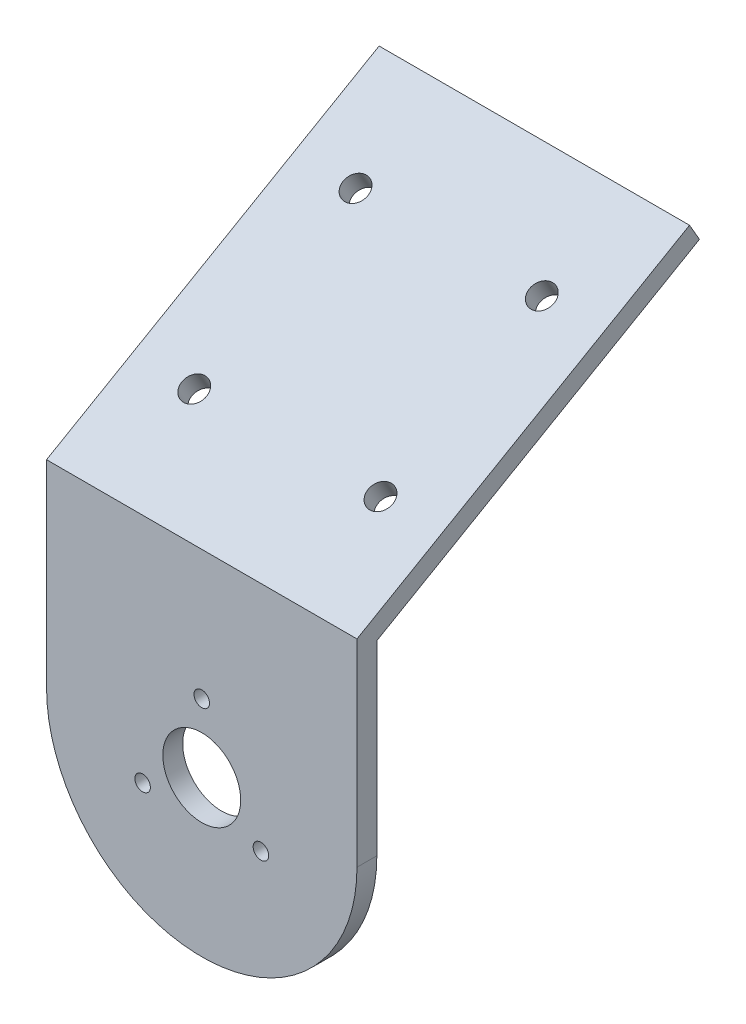
ISO-10303-21;
HEADER;
FILE_DESCRIPTION(('STEP AP214'),'2;1');
FILE_NAME('part.step','',(''),(''),'','','');
FILE_SCHEMA(('AUTOMOTIVE_DESIGN { 1 0 10303 214 1 1 1 1 }'));
ENDSEC;
DATA;
#1=APPLICATION_CONTEXT('core data for automotive mechanical design processes');
#2=APPLICATION_PROTOCOL_DEFINITION('international standard','automotive_design',2000,#1);
#3=PRODUCT_CONTEXT('',#1,'mechanical');
#4=PRODUCT('Part','Part','',(#3));
#5=PRODUCT_RELATED_PRODUCT_CATEGORY('part','',(#4));
#6=PRODUCT_DEFINITION_FORMATION('','',#4);
#7=PRODUCT_DEFINITION_CONTEXT('part definition',#1,'design');
#8=PRODUCT_DEFINITION('design','',#6,#7);
#9=PRODUCT_DEFINITION_SHAPE('','',#8);
#10=(LENGTH_UNIT() NAMED_UNIT(*) SI_UNIT(.MILLI.,.METRE.));
#11=(NAMED_UNIT(*) PLANE_ANGLE_UNIT() SI_UNIT($,.RADIAN.));
#12=(NAMED_UNIT(*) SI_UNIT($,.STERADIAN.) SOLID_ANGLE_UNIT());
#13=UNCERTAINTY_MEASURE_WITH_UNIT(LENGTH_MEASURE(1.E-05),#10,'distance_accuracy_value','');
#14=(GEOMETRIC_REPRESENTATION_CONTEXT(3) GLOBAL_UNCERTAINTY_ASSIGNED_CONTEXT((#13)) GLOBAL_UNIT_ASSIGNED_CONTEXT((#10,
#11,#12)) REPRESENTATION_CONTEXT('',''));
#15=CARTESIAN_POINT('',(0.,0.,0.));
#16=DIRECTION('',(0.,0.,1.));
#17=DIRECTION('',(1.,0.,0.));
#18=AXIS2_PLACEMENT_3D('',#15,#16,#17);
#19=CARTESIAN_POINT('',(9.526279441629,-5.5,77.5303437365925));
#20=DIRECTION('',(0.,0.,-1.));
#21=DIRECTION('',(-1.,0.,0.));
#22=AXIS2_PLACEMENT_3D('',#19,#20,#21);
#23=CYLINDRICAL_SURFACE('',#22,1.24999999999999);
#24=CARTESIAN_POINT('',(9.526279441629,-5.5,0.));
#25=DIRECTION('',(0.,0.,1.));
#26=DIRECTION('',(1.,0.,0.));
#27=AXIS2_PLACEMENT_3D('',#24,#25,#26);
#28=CIRCLE('',#27,1.24999999999999);
#29=CARTESIAN_POINT('',(10.776279441629,-5.5,0.));
#30=VERTEX_POINT('',#29);
#31=EDGE_CURVE('E120',#30,#30,#28,.T.);
#32=ORIENTED_EDGE('',*,*,#31,.F.);
#33=EDGE_LOOP('',(#32));
#34=FACE_BOUND('',#33,.T.);
#35=CARTESIAN_POINT('',(9.526279441629,-5.5,3.19999999999999));
#36=DIRECTION('',(0.,0.,1.));
#37=DIRECTION('',(1.,0.,0.));
#38=AXIS2_PLACEMENT_3D('',#35,#36,#37);
#39=CIRCLE('',#38,1.24999999999999);
#40=CARTESIAN_POINT('',(10.776279441629,-5.5,3.19999999999999));
#41=VERTEX_POINT('',#40);
#42=EDGE_CURVE('E139',#41,#41,#39,.T.);
#43=ORIENTED_EDGE('',*,*,#42,.T.);
#44=EDGE_LOOP('',(#43));
#45=FACE_BOUND('',#44,.T.);
#46=ADVANCED_FACE('F32',(#34,#45),#23,.F.);
#47=CARTESIAN_POINT('',(0.,11.,77.5303437365925));
#48=DIRECTION('',(0.,0.,-1.));
#49=DIRECTION('',(-1.,0.,0.));
#50=AXIS2_PLACEMENT_3D('',#47,#48,#49);
#51=CYLINDRICAL_SURFACE('',#50,1.24999999999999);
#52=CARTESIAN_POINT('',(0.,11.,0.));
#53=DIRECTION('',(0.,0.,1.));
#54=DIRECTION('',(1.,0.,0.));
#55=AXIS2_PLACEMENT_3D('',#52,#53,#54);
#56=CIRCLE('',#55,1.24999999999999);
#57=CARTESIAN_POINT('',(1.24999999999999,11.,0.));
#58=VERTEX_POINT('',#57);
#59=EDGE_CURVE('E117',#58,#58,#56,.T.);
#60=ORIENTED_EDGE('',*,*,#59,.F.);
#61=EDGE_LOOP('',(#60));
#62=FACE_BOUND('',#61,.T.);
#63=CARTESIAN_POINT('',(0.,11.,3.19999999999999));
#64=DIRECTION('',(0.,0.,1.));
#65=DIRECTION('',(1.,0.,0.));
#66=AXIS2_PLACEMENT_3D('',#63,#64,#65);
#67=CIRCLE('',#66,1.24999999999999);
#68=CARTESIAN_POINT('',(1.24999999999999,11.,3.19999999999999));
#69=VERTEX_POINT('',#68);
#70=EDGE_CURVE('E136',#69,#69,#67,.T.);
#71=ORIENTED_EDGE('',*,*,#70,.T.);
#72=EDGE_LOOP('',(#71));
#73=FACE_BOUND('',#72,.T.);
#74=ADVANCED_FACE('F208',(#62,#73),#51,.F.);
#75=CARTESIAN_POINT('',(0.,0.,77.5303437365925));
#76=DIRECTION('',(0.,0.,-1.));
#77=DIRECTION('',(-1.,0.,0.));
#78=AXIS2_PLACEMENT_3D('',#75,#76,#77);
#79=CYLINDRICAL_SURFACE('',#78,6.27324302627625);
#80=CARTESIAN_POINT('',(0.,0.,0.));
#81=DIRECTION('',(0.,0.,1.));
#82=DIRECTION('',(1.,0.,0.));
#83=AXIS2_PLACEMENT_3D('',#80,#81,#82);
#84=CIRCLE('',#83,6.27324302627625);
#85=CARTESIAN_POINT('',(6.27324302627625,0.,0.));
#86=VERTEX_POINT('',#85);
#87=EDGE_CURVE('E114',#86,#86,#84,.T.);
#88=ORIENTED_EDGE('',*,*,#87,.F.);
#89=EDGE_LOOP('',(#88));
#90=FACE_BOUND('',#89,.T.);
#91=CARTESIAN_POINT('',(0.,0.,3.19999999999999));
#92=DIRECTION('',(0.,0.,1.));
#93=DIRECTION('',(1.,0.,0.));
#94=AXIS2_PLACEMENT_3D('',#91,#92,#93);
#95=CIRCLE('',#94,6.27324302627625);
#96=CARTESIAN_POINT('',(6.27324302627625,0.,3.19999999999999));
#97=VERTEX_POINT('',#96);
#98=EDGE_CURVE('E133',#97,#97,#95,.T.);
#99=ORIENTED_EDGE('',*,*,#98,.T.);
#100=EDGE_LOOP('',(#99));
#101=FACE_BOUND('',#100,.T.);
#102=ADVANCED_FACE('F214',(#90,#101),#79,.F.);
#103=CARTESIAN_POINT('',(-25.,0.,77.5303437365925));
#104=DIRECTION('',(1.,0.,0.));
#105=DIRECTION('',(0.,1.,0.));
#106=AXIS2_PLACEMENT_3D('',#103,#104,#105);
#107=PLANE('',#106);
#108=DIRECTION('',(0.,-1.,0.));
#109=VECTOR('',#108,1.);
#110=CARTESIAN_POINT('',(-25.,0.,3.19999999999999));
#111=LINE('',#110,#109);
#112=CARTESIAN_POINT('',(-25.,31.8475208614068,3.19999999999999));
#113=VERTEX_POINT('',#112);
#114=CARTESIAN_POINT('',(-25.,0.,3.19999999999999));
#115=VERTEX_POINT('',#114);
#116=EDGE_CURVE('E130',#113,#115,#111,.T.);
#117=ORIENTED_EDGE('',*,*,#116,.F.);
#118=DIRECTION('',(0.,0.499999999999998,-0.86602540378444));
#119=VECTOR('',#118,1.);
#120=CARTESIAN_POINT('',(-25.,62.7712812921101,-50.3615242270664));
#121=LINE('',#120,#119);
#122=CARTESIAN_POINT('',(-25.,62.7712812921101,-50.3615242270664));
#123=VERTEX_POINT('',#122);
#124=EDGE_CURVE('E144',#113,#123,#121,.T.);
#125=ORIENTED_EDGE('',*,*,#124,.T.);
#126=DIRECTION('',(0.,-0.86602540378444,-0.499999999999998));
#127=VECTOR('',#126,1.);
#128=CARTESIAN_POINT('',(-25.,59.9999999999998,-51.9615242270664));
#129=LINE('',#128,#127);
#130=CARTESIAN_POINT('',(-25.,59.9999999999999,-51.9615242270664));
#131=VERTEX_POINT('',#130);
#132=EDGE_CURVE('E152',#123,#131,#129,.T.);
#133=ORIENTED_EDGE('',*,*,#132,.T.);
#134=DIRECTION('',(0.,-0.499999999999998,0.86602540378444));
#135=VECTOR('',#134,1.);
#136=CARTESIAN_POINT('',(-25.,30.,0.));
#137=LINE('',#136,#135);
#138=CARTESIAN_POINT('',(-25.,30.,0.));
#139=VERTEX_POINT('',#138);
#140=EDGE_CURVE('E142',#131,#139,#137,.T.);
#141=ORIENTED_EDGE('',*,*,#140,.T.);
#142=DIRECTION('',(0.,-1.,0.));
#143=VECTOR('',#142,1.);
#144=CARTESIAN_POINT('',(-25.,0.,0.));
#145=LINE('',#144,#143);
#146=CARTESIAN_POINT('',(-25.,0.,0.));
#147=VERTEX_POINT('',#146);
#148=EDGE_CURVE('E108',#139,#147,#145,.T.);
#149=ORIENTED_EDGE('',*,*,#148,.T.);
#150=DIRECTION('',(0.,0.,-1.));
#151=VECTOR('',#150,1.);
#152=CARTESIAN_POINT('',(-25.,0.,77.5303437365925));
#153=LINE('',#152,#151);
#154=EDGE_CURVE('E41',#115,#147,#153,.T.);
#155=ORIENTED_EDGE('',*,*,#154,.F.);
#156=EDGE_LOOP('',(#117,#125,#133,#141,#149,#155));
#157=FACE_BOUND('',#156,.T.);
#158=ADVANCED_FACE('F206',(#157),#107,.F.);
#159=CARTESIAN_POINT('',(25.,30.,77.5303437365925));
#160=DIRECTION('',(-1.,0.,0.));
#161=DIRECTION('',(0.,-1.,0.));
#162=AXIS2_PLACEMENT_3D('',#159,#160,#161);
#163=PLANE('',#162);
#164=DIRECTION('',(0.,1.,0.));
#165=VECTOR('',#164,1.);
#166=CARTESIAN_POINT('',(25.,30.,3.19999999999999));
#167=LINE('',#166,#165);
#168=CARTESIAN_POINT('',(25.,0.,3.19999999999999));
#169=VERTEX_POINT('',#168);
#170=CARTESIAN_POINT('',(25.,31.8475208614068,3.2));
#171=VERTEX_POINT('',#170);
#172=EDGE_CURVE('E47',#169,#171,#167,.T.);
#173=ORIENTED_EDGE('',*,*,#172,.F.);
#174=DIRECTION('',(0.,0.,-1.));
#175=VECTOR('',#174,1.);
#176=CARTESIAN_POINT('',(25.,0.,77.5303437365925));
#177=LINE('',#176,#175);
#178=CARTESIAN_POINT('',(25.,0.,0.));
#179=VERTEX_POINT('',#178);
#180=EDGE_CURVE('E11',#169,#179,#177,.T.);
#181=ORIENTED_EDGE('',*,*,#180,.T.);
#182=DIRECTION('',(0.,1.,0.));
#183=VECTOR('',#182,1.);
#184=CARTESIAN_POINT('',(25.,30.,0.));
#185=LINE('',#184,#183);
#186=CARTESIAN_POINT('',(25.,30.,0.));
#187=VERTEX_POINT('',#186);
#188=EDGE_CURVE('E99',#179,#187,#185,.T.);
#189=ORIENTED_EDGE('',*,*,#188,.T.);
#190=DIRECTION('',(0.,0.499999999999998,-0.86602540378444));
#191=VECTOR('',#190,1.);
#192=CARTESIAN_POINT('',(25.,30.,0.));
#193=LINE('',#192,#191);
#194=CARTESIAN_POINT('',(25.,59.9999999999999,-51.9615242270664));
#195=VERTEX_POINT('',#194);
#196=EDGE_CURVE('E84',#187,#195,#193,.T.);
#197=ORIENTED_EDGE('',*,*,#196,.T.);
#198=DIRECTION('',(0.,0.86602540378444,0.499999999999998));
#199=VECTOR('',#198,1.);
#200=CARTESIAN_POINT('',(25.,59.9999999999999,-51.9615242270664));
#201=LINE('',#200,#199);
#202=CARTESIAN_POINT('',(25.,62.7712812921101,-50.3615242270664));
#203=VERTEX_POINT('',#202);
#204=EDGE_CURVE('E95',#195,#203,#201,.T.);
#205=ORIENTED_EDGE('',*,*,#204,.T.);
#206=DIRECTION('',(0.,-0.499999999999998,0.86602540378444));
#207=VECTOR('',#206,1.);
#208=CARTESIAN_POINT('',(25.,62.7712812921101,-50.3615242270664));
#209=LINE('',#208,#207);
#210=EDGE_CURVE('E147',#203,#171,#209,.T.);
#211=ORIENTED_EDGE('',*,*,#210,.T.);
#212=EDGE_LOOP('',(#173,#181,#189,#197,#205,#211));
#213=FACE_BOUND('',#212,.T.);
#214=ADVANCED_FACE('F100',(#213),#163,.F.);
#215=CARTESIAN_POINT('',(0.,0.,77.5303437365925));
#216=DIRECTION('',(0.,0.,-1.));
#217=DIRECTION('',(-1.,0.,0.));
#218=AXIS2_PLACEMENT_3D('',#215,#216,#217);
#219=CYLINDRICAL_SURFACE('',#218,25.);
#220=CARTESIAN_POINT('',(0.,0.,3.19999999999999));
#221=DIRECTION('',(0.,0.,1.));
#222=DIRECTION('',(1.,0.,0.));
#223=AXIS2_PLACEMENT_3D('',#220,#221,#222);
#224=CIRCLE('',#223,25.);
#225=EDGE_CURVE('E126',#115,#169,#224,.T.);
#226=ORIENTED_EDGE('',*,*,#225,.F.);
#227=ORIENTED_EDGE('',*,*,#154,.T.);
#228=CARTESIAN_POINT('',(0.,0.,0.));
#229=DIRECTION('',(0.,0.,1.));
#230=DIRECTION('',(1.,0.,0.));
#231=AXIS2_PLACEMENT_3D('',#228,#229,#230);
#232=CIRCLE('',#231,25.);
#233=EDGE_CURVE('E103',#147,#179,#232,.T.);
#234=ORIENTED_EDGE('',*,*,#233,.T.);
#235=ORIENTED_EDGE('',*,*,#180,.F.);
#236=EDGE_LOOP('',(#226,#227,#234,#235));
#237=FACE_BOUND('',#236,.T.);
#238=ADVANCED_FACE('F34',(#237),#219,.T.);
#239=CARTESIAN_POINT('',(0.,0.,0.));
#240=DIRECTION('',(0.,0.,1.));
#241=DIRECTION('',(1.,0.,0.));
#242=AXIS2_PLACEMENT_3D('',#239,#240,#241);
#243=PLANE('',#242);
#244=ORIENTED_EDGE('',*,*,#233,.F.);
#245=ORIENTED_EDGE('',*,*,#148,.F.);
#246=DIRECTION('',(-1.,0.,0.));
#247=VECTOR('',#246,1.);
#248=CARTESIAN_POINT('',(-25.,30.,0.));
#249=LINE('',#248,#247);
#250=EDGE_CURVE('E89',#187,#139,#249,.T.);
#251=ORIENTED_EDGE('',*,*,#250,.F.);
#252=ORIENTED_EDGE('',*,*,#188,.F.);
#253=EDGE_LOOP('',(#244,#245,#251,#252));
#254=FACE_BOUND('',#253,.T.);
#255=ORIENTED_EDGE('',*,*,#87,.T.);
#256=EDGE_LOOP('',(#255));
#257=FACE_BOUND('',#256,.T.);
#258=ORIENTED_EDGE('',*,*,#59,.T.);
#259=EDGE_LOOP('',(#258));
#260=FACE_BOUND('',#259,.T.);
#261=ORIENTED_EDGE('',*,*,#31,.T.);
#262=EDGE_LOOP('',(#261));
#263=FACE_BOUND('',#262,.T.);
#264=CARTESIAN_POINT('',(-9.526279441629,-5.5,0.));
#265=DIRECTION('',(0.,0.,1.));
#266=DIRECTION('',(1.,0.,0.));
#267=AXIS2_PLACEMENT_3D('',#264,#265,#266);
#268=CIRCLE('',#267,1.24999999999999);
#269=CARTESIAN_POINT('',(-8.27627944162901,-5.5,0.));
#270=VERTEX_POINT('',#269);
#271=EDGE_CURVE('E123',#270,#270,#268,.T.);
#272=ORIENTED_EDGE('',*,*,#271,.T.);
#273=EDGE_LOOP('',(#272));
#274=FACE_BOUND('',#273,.T.);
#275=ADVANCED_FACE('F106',(#254,#257,#260,#263,#274),#243,.F.);
#276=CARTESIAN_POINT('',(-9.526279441629,-5.5,77.5303437365925));
#277=DIRECTION('',(0.,0.,-1.));
#278=DIRECTION('',(-1.,0.,0.));
#279=AXIS2_PLACEMENT_3D('',#276,#277,#278);
#280=CYLINDRICAL_SURFACE('',#279,1.24999999999999);
#281=ORIENTED_EDGE('',*,*,#271,.F.);
#282=EDGE_LOOP('',(#281));
#283=FACE_BOUND('',#282,.T.);
#284=CARTESIAN_POINT('',(-9.526279441629,-5.5,3.19999999999999));
#285=DIRECTION('',(0.,0.,1.));
#286=DIRECTION('',(1.,0.,0.));
#287=AXIS2_PLACEMENT_3D('',#284,#285,#286);
#288=CIRCLE('',#287,1.24999999999999);
#289=CARTESIAN_POINT('',(-8.27627944162901,-5.5,3.19999999999999));
#290=VERTEX_POINT('',#289);
#291=EDGE_CURVE('E36',#290,#290,#288,.T.);
#292=ORIENTED_EDGE('',*,*,#291,.T.);
#293=EDGE_LOOP('',(#292));
#294=FACE_BOUND('',#293,.T.);
#295=ADVANCED_FACE('F204',(#283,#294),#280,.F.);
#296=CARTESIAN_POINT('',(0.,0.,3.2));
#297=DIRECTION('',(0.,0.,1.));
#298=DIRECTION('',(1.,0.,0.));
#299=AXIS2_PLACEMENT_3D('',#296,#297,#298);
#300=PLANE('',#299);
#301=ORIENTED_EDGE('',*,*,#291,.F.);
#302=EDGE_LOOP('',(#301));
#303=FACE_BOUND('',#302,.T.);
#304=ORIENTED_EDGE('',*,*,#42,.F.);
#305=EDGE_LOOP('',(#304));
#306=FACE_BOUND('',#305,.T.);
#307=ORIENTED_EDGE('',*,*,#70,.F.);
#308=EDGE_LOOP('',(#307));
#309=FACE_BOUND('',#308,.T.);
#310=ORIENTED_EDGE('',*,*,#98,.F.);
#311=EDGE_LOOP('',(#310));
#312=FACE_BOUND('',#311,.T.);
#313=ORIENTED_EDGE('',*,*,#116,.T.);
#314=ORIENTED_EDGE('',*,*,#225,.T.);
#315=ORIENTED_EDGE('',*,*,#172,.T.);
#316=DIRECTION('',(1.,0.,0.));
#317=VECTOR('',#316,1.);
#318=CARTESIAN_POINT('',(-89.1619095147567,31.8475208614068,3.2));
#319=LINE('',#318,#317);
#320=EDGE_CURVE('E149',#113,#171,#319,.T.);
#321=ORIENTED_EDGE('',*,*,#320,.F.);
#322=EDGE_LOOP('',(#313,#314,#315,#321));
#323=FACE_BOUND('',#322,.T.);
#324=ADVANCED_FACE('F187',(#303,#306,#309,#312,#323),#300,.T.);
#325=CARTESIAN_POINT('',(-89.1619095147567,62.7712812921101,-50.3615242270664));
#326=DIRECTION('',(0.,0.86602540378444,0.499999999999998));
#327=DIRECTION('',(0.,-0.499999999999998,0.86602540378444));
#328=AXIS2_PLACEMENT_3D('',#325,#326,#327);
#329=PLANE('',#328);
#330=CARTESIAN_POINT('',(-15.,39.8094010767585,-10.5903810567666));
#331=DIRECTION('',(0.,0.86602540378444,0.499999999999998));
#332=DIRECTION('',(0.,-0.499999999999998,0.86602540378444));
#333=AXIS2_PLACEMENT_3D('',#330,#331,#332);
#334=CIRCLE('',#333,2.);
#335=CARTESIAN_POINT('',(-15.,38.8094010767585,-8.85833024919773));
#336=VERTEX_POINT('',#335);
#337=EDGE_CURVE('E166',#336,#336,#334,.T.);
#338=ORIENTED_EDGE('',*,*,#337,.F.);
#339=EDGE_LOOP('',(#338));
#340=FACE_BOUND('',#339,.T.);
#341=CARTESIAN_POINT('',(15.,54.8094010767584,-36.5711431702998));
#342=DIRECTION('',(0.,0.86602540378444,0.499999999999998));
#343=DIRECTION('',(0.,-0.499999999999998,0.86602540378444));
#344=AXIS2_PLACEMENT_3D('',#341,#342,#343);
#345=CIRCLE('',#344,2.00000000000001);
#346=CARTESIAN_POINT('',(15.,53.8094010767584,-34.8390923627309));
#347=VERTEX_POINT('',#346);
#348=EDGE_CURVE('E172',#347,#347,#345,.T.);
#349=ORIENTED_EDGE('',*,*,#348,.F.);
#350=EDGE_LOOP('',(#349));
#351=FACE_BOUND('',#350,.T.);
#352=CARTESIAN_POINT('',(-15.,54.8094010767584,-36.5711431702998));
#353=DIRECTION('',(0.,0.86602540378444,0.499999999999998));
#354=DIRECTION('',(0.,-0.499999999999998,0.86602540378444));
#355=AXIS2_PLACEMENT_3D('',#352,#353,#354);
#356=CIRCLE('',#355,2.);
#357=CARTESIAN_POINT('',(-15.,53.8094010767584,-34.8390923627309));
#358=VERTEX_POINT('',#357);
#359=EDGE_CURVE('E160',#358,#358,#356,.T.);
#360=ORIENTED_EDGE('',*,*,#359,.F.);
#361=EDGE_LOOP('',(#360));
#362=FACE_BOUND('',#361,.T.);
#363=CARTESIAN_POINT('',(15.,39.8094010767585,-10.5903810567666));
#364=DIRECTION('',(0.,0.86602540378444,0.499999999999998));
#365=DIRECTION('',(0.,-0.499999999999998,0.86602540378444));
#366=AXIS2_PLACEMENT_3D('',#363,#364,#365);
#367=CIRCLE('',#366,2.00000000000001);
#368=CARTESIAN_POINT('',(15.,38.8094010767585,-8.85833024919772));
#369=VERTEX_POINT('',#368);
#370=EDGE_CURVE('E96',#369,#369,#367,.T.);
#371=ORIENTED_EDGE('',*,*,#370,.F.);
#372=EDGE_LOOP('',(#371));
#373=FACE_BOUND('',#372,.T.);
#374=ORIENTED_EDGE('',*,*,#124,.F.);
#375=ORIENTED_EDGE('',*,*,#320,.T.);
#376=ORIENTED_EDGE('',*,*,#210,.F.);
#377=DIRECTION('',(1.,0.,0.));
#378=VECTOR('',#377,1.);
#379=CARTESIAN_POINT('',(-89.1619095147567,62.7712812921101,-50.3615242270664));
#380=LINE('',#379,#378);
#381=EDGE_CURVE('E146',#123,#203,#380,.T.);
#382=ORIENTED_EDGE('',*,*,#381,.F.);
#383=EDGE_LOOP('',(#374,#375,#376,#382));
#384=FACE_BOUND('',#383,.T.);
#385=ADVANCED_FACE('F183',(#340,#351,#362,#373,#384),#329,.T.);
#386=CARTESIAN_POINT('',(-89.1619095147567,59.9999999999999,-51.9615242270664));
#387=DIRECTION('',(0.,0.499999999999998,-0.86602540378444));
#388=DIRECTION('',(0.,0.86602540378444,0.499999999999998));
#389=AXIS2_PLACEMENT_3D('',#386,#387,#388);
#390=PLANE('',#389);
#391=ORIENTED_EDGE('',*,*,#132,.F.);
#392=ORIENTED_EDGE('',*,*,#381,.T.);
#393=ORIENTED_EDGE('',*,*,#204,.F.);
#394=DIRECTION('',(1.,0.,0.));
#395=VECTOR('',#394,1.);
#396=CARTESIAN_POINT('',(-89.1619095147567,59.9999999999999,-51.9615242270664));
#397=LINE('',#396,#395);
#398=EDGE_CURVE('E92',#131,#195,#397,.T.);
#399=ORIENTED_EDGE('',*,*,#398,.F.);
#400=EDGE_LOOP('',(#391,#392,#393,#399));
#401=FACE_BOUND('',#400,.T.);
#402=ADVANCED_FACE('F186',(#401),#390,.T.);
#403=CARTESIAN_POINT('',(-89.1619095147567,30.,0.));
#404=DIRECTION('',(0.,-0.86602540378444,-0.499999999999998));
#405=DIRECTION('',(0.,0.499999999999998,-0.86602540378444));
#406=AXIS2_PLACEMENT_3D('',#403,#404,#405);
#407=PLANE('',#406);
#408=CARTESIAN_POINT('',(-15.,37.0381197846483,-12.1903810567666));
#409=DIRECTION('',(0.,-0.86602540378444,-0.499999999999998));
#410=DIRECTION('',(0.,0.499999999999998,-0.86602540378444));
#411=AXIS2_PLACEMENT_3D('',#408,#409,#410);
#412=CIRCLE('',#411,2.);
#413=CARTESIAN_POINT('',(-15.,38.0381197846482,-13.9224318643355));
#414=VERTEX_POINT('',#413);
#415=EDGE_CURVE('E163',#414,#414,#412,.F.);
#416=ORIENTED_EDGE('',*,*,#415,.T.);
#417=EDGE_LOOP('',(#416));
#418=FACE_BOUND('',#417,.T.);
#419=CARTESIAN_POINT('',(15.,52.0381197846482,-38.1711431702998));
#420=DIRECTION('',(0.,-0.86602540378444,-0.499999999999998));
#421=DIRECTION('',(0.,0.499999999999998,-0.86602540378444));
#422=AXIS2_PLACEMENT_3D('',#419,#420,#421);
#423=CIRCLE('',#422,2.00000000000001);
#424=CARTESIAN_POINT('',(15.,53.0381197846482,-39.9031939778687));
#425=VERTEX_POINT('',#424);
#426=EDGE_CURVE('E169',#425,#425,#423,.F.);
#427=ORIENTED_EDGE('',*,*,#426,.T.);
#428=EDGE_LOOP('',(#427));
#429=FACE_BOUND('',#428,.T.);
#430=CARTESIAN_POINT('',(-15.,52.0381197846482,-38.1711431702998));
#431=DIRECTION('',(0.,-0.86602540378444,-0.499999999999998));
#432=DIRECTION('',(0.,0.499999999999998,-0.86602540378444));
#433=AXIS2_PLACEMENT_3D('',#430,#431,#432);
#434=CIRCLE('',#433,2.);
#435=CARTESIAN_POINT('',(-15.,53.0381197846482,-39.9031939778687));
#436=VERTEX_POINT('',#435);
#437=EDGE_CURVE('E175',#436,#436,#434,.F.);
#438=ORIENTED_EDGE('',*,*,#437,.T.);
#439=EDGE_LOOP('',(#438));
#440=FACE_BOUND('',#439,.T.);
#441=CARTESIAN_POINT('',(15.,37.0381197846483,-12.1903810567666));
#442=DIRECTION('',(0.,-0.86602540378444,-0.499999999999998));
#443=DIRECTION('',(0.,0.499999999999998,-0.86602540378444));
#444=AXIS2_PLACEMENT_3D('',#441,#442,#443);
#445=CIRCLE('',#444,2.00000000000001);
#446=CARTESIAN_POINT('',(15.,38.0381197846483,-13.9224318643355));
#447=VERTEX_POINT('',#446);
#448=EDGE_CURVE('E157',#447,#447,#445,.F.);
#449=ORIENTED_EDGE('',*,*,#448,.T.);
#450=EDGE_LOOP('',(#449));
#451=FACE_BOUND('',#450,.T.);
#452=ORIENTED_EDGE('',*,*,#140,.F.);
#453=ORIENTED_EDGE('',*,*,#398,.T.);
#454=ORIENTED_EDGE('',*,*,#196,.F.);
#455=ORIENTED_EDGE('',*,*,#250,.T.);
#456=EDGE_LOOP('',(#452,#453,#454,#455));
#457=FACE_BOUND('',#456,.T.);
#458=ADVANCED_FACE('F87',(#418,#429,#440,#451,#457),#407,.T.);
#459=CARTESIAN_POINT('',(15.,-26.7130632280537,-48.997143730307));
#460=DIRECTION('',(0.,0.86602540378444,0.499999999999998));
#461=DIRECTION('',(0.,-0.499999999999998,0.86602540378444));
#462=AXIS2_PLACEMENT_3D('',#459,#460,#461);
#463=CYLINDRICAL_SURFACE('',#462,2.00000000000001);
#464=ORIENTED_EDGE('',*,*,#448,.F.);
#465=EDGE_LOOP('',(#464));
#466=FACE_BOUND('',#465,.T.);
#467=ORIENTED_EDGE('',*,*,#370,.T.);
#468=EDGE_LOOP('',(#467));
#469=FACE_BOUND('',#468,.T.);
#470=ADVANCED_FACE('F234',(#466,#469),#463,.F.);
#471=CARTESIAN_POINT('',(-15.,-11.7130632280538,-74.9779058438402));
#472=DIRECTION('',(0.,0.86602540378444,0.499999999999998));
#473=DIRECTION('',(0.,-0.499999999999998,0.86602540378444));
#474=AXIS2_PLACEMENT_3D('',#471,#472,#473);
#475=CYLINDRICAL_SURFACE('',#474,2.);
#476=ORIENTED_EDGE('',*,*,#437,.F.);
#477=EDGE_LOOP('',(#476));
#478=FACE_BOUND('',#477,.T.);
#479=ORIENTED_EDGE('',*,*,#359,.T.);
#480=EDGE_LOOP('',(#479));
#481=FACE_BOUND('',#480,.T.);
#482=ADVANCED_FACE('F181',(#478,#481),#475,.F.);
#483=CARTESIAN_POINT('',(15.,-11.7130632280538,-74.9779058438402));
#484=DIRECTION('',(0.,0.86602540378444,0.499999999999998));
#485=DIRECTION('',(0.,-0.499999999999998,0.86602540378444));
#486=AXIS2_PLACEMENT_3D('',#483,#484,#485);
#487=CYLINDRICAL_SURFACE('',#486,2.00000000000001);
#488=ORIENTED_EDGE('',*,*,#426,.F.);
#489=EDGE_LOOP('',(#488));
#490=FACE_BOUND('',#489,.T.);
#491=ORIENTED_EDGE('',*,*,#348,.T.);
#492=EDGE_LOOP('',(#491));
#493=FACE_BOUND('',#492,.T.);
#494=ADVANCED_FACE('F305',(#490,#493),#487,.F.);
#495=CARTESIAN_POINT('',(-15.,-26.7130632280537,-48.997143730307));
#496=DIRECTION('',(0.,0.86602540378444,0.499999999999998));
#497=DIRECTION('',(0.,-0.499999999999998,0.86602540378444));
#498=AXIS2_PLACEMENT_3D('',#495,#496,#497);
#499=CYLINDRICAL_SURFACE('',#498,2.);
#500=ORIENTED_EDGE('',*,*,#415,.F.);
#501=EDGE_LOOP('',(#500));
#502=FACE_BOUND('',#501,.T.);
#503=ORIENTED_EDGE('',*,*,#337,.T.);
#504=EDGE_LOOP('',(#503));
#505=FACE_BOUND('',#504,.T.);
#506=ADVANCED_FACE('F315',(#502,#505),#499,.F.);
#507=CLOSED_SHELL('',(#46,#74,#102,#158,#214,#238,#275,#295,#324,#385,#402,#458,#470,#482,#494,#506));
#508=MANIFOLD_SOLID_BREP('B2',#507);
#509=ADVANCED_BREP_SHAPE_REPRESENTATION('',(#18,#508),#14);
#510=SHAPE_DEFINITION_REPRESENTATION(#9,#509);
ENDSEC;
END-ISO-10303-21;
